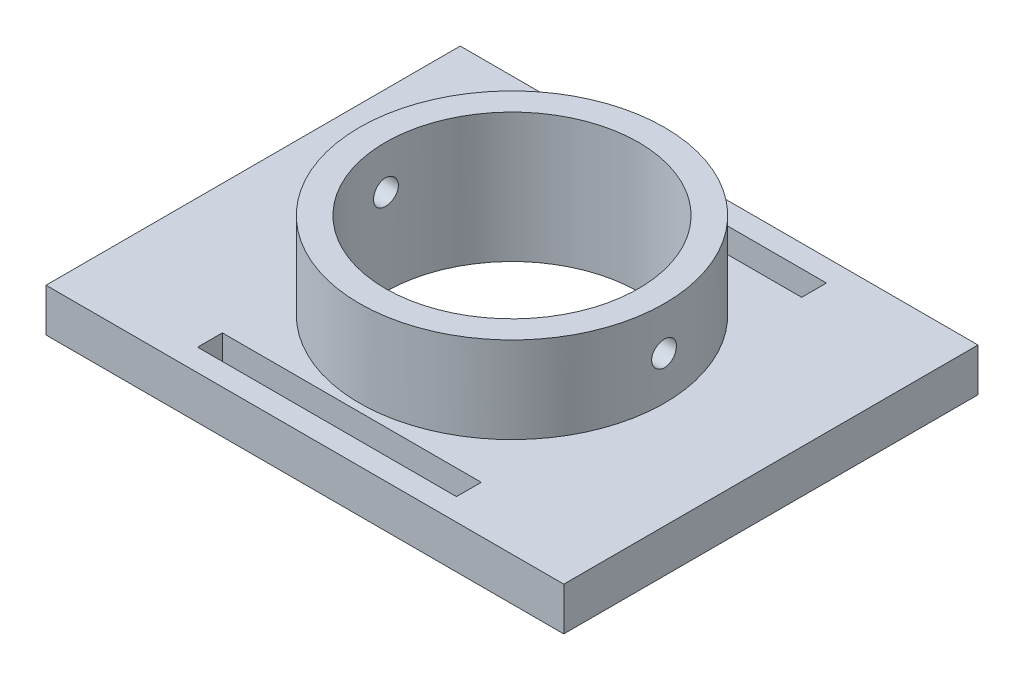
ISO-10303-21;
HEADER;
FILE_DESCRIPTION(('STEP AP214'),'2;1');
FILE_NAME('part.step','',(''),(''),'','','');
FILE_SCHEMA(('AUTOMOTIVE_DESIGN { 1 0 10303 214 1 1 1 1 }'));
ENDSEC;
DATA;
#1=APPLICATION_CONTEXT('core data for automotive mechanical design processes');
#2=APPLICATION_PROTOCOL_DEFINITION('international standard','automotive_design',2000,#1);
#3=PRODUCT_CONTEXT('',#1,'mechanical');
#4=PRODUCT('Part','Part','',(#3));
#5=PRODUCT_RELATED_PRODUCT_CATEGORY('part','',(#4));
#6=PRODUCT_DEFINITION_FORMATION('','',#4);
#7=PRODUCT_DEFINITION_CONTEXT('part definition',#1,'design');
#8=PRODUCT_DEFINITION('design','',#6,#7);
#9=PRODUCT_DEFINITION_SHAPE('','',#8);
#10=(LENGTH_UNIT() NAMED_UNIT(*) SI_UNIT(.MILLI.,.METRE.));
#11=(NAMED_UNIT(*) PLANE_ANGLE_UNIT() SI_UNIT($,.RADIAN.));
#12=(NAMED_UNIT(*) SI_UNIT($,.STERADIAN.) SOLID_ANGLE_UNIT());
#13=UNCERTAINTY_MEASURE_WITH_UNIT(LENGTH_MEASURE(1.E-05),#10,'distance_accuracy_value','');
#14=(GEOMETRIC_REPRESENTATION_CONTEXT(3) GLOBAL_UNCERTAINTY_ASSIGNED_CONTEXT((#13)) GLOBAL_UNIT_ASSIGNED_CONTEXT((#10,
#11,#12)) REPRESENTATION_CONTEXT('',''));
#15=CARTESIAN_POINT('',(0.,0.,0.));
#16=DIRECTION('',(0.,0.,1.));
#17=DIRECTION('',(1.,0.,0.));
#18=AXIS2_PLACEMENT_3D('',#15,#16,#17);
#19=CARTESIAN_POINT('',(-30.,5.,-24.));
#20=DIRECTION('',(0.,0.,-1.));
#21=DIRECTION('',(-1.,0.,0.));
#22=AXIS2_PLACEMENT_3D('',#19,#20,#21);
#23=PLANE('',#22);
#24=DIRECTION('',(1.,0.,0.));
#25=VECTOR('',#24,1.);
#26=CARTESIAN_POINT('',(-30.,0.,-24.));
#27=LINE('',#26,#25);
#28=CARTESIAN_POINT('',(-30.,0.,-24.));
#29=VERTEX_POINT('',#28);
#30=CARTESIAN_POINT('',(30.,0.,-24.));
#31=VERTEX_POINT('',#30);
#32=EDGE_CURVE('E210',#29,#31,#27,.T.);
#33=ORIENTED_EDGE('',*,*,#32,.F.);
#34=DIRECTION('',(0.,-1.,0.));
#35=VECTOR('',#34,1.);
#36=CARTESIAN_POINT('',(-30.,5.,-24.));
#37=LINE('',#36,#35);
#38=CARTESIAN_POINT('',(-30.,5.,-24.));
#39=VERTEX_POINT('',#38);
#40=EDGE_CURVE('E45',#39,#29,#37,.T.);
#41=ORIENTED_EDGE('',*,*,#40,.F.);
#42=DIRECTION('',(1.,0.,0.));
#43=VECTOR('',#42,1.);
#44=CARTESIAN_POINT('',(-30.,5.,-24.));
#45=LINE('',#44,#43);
#46=CARTESIAN_POINT('',(30.,5.,-24.));
#47=VERTEX_POINT('',#46);
#48=EDGE_CURVE('E211',#39,#47,#45,.T.);
#49=ORIENTED_EDGE('',*,*,#48,.T.);
#50=DIRECTION('',(0.,-1.,0.));
#51=VECTOR('',#50,1.);
#52=CARTESIAN_POINT('',(30.,5.,-24.));
#53=LINE('',#52,#51);
#54=EDGE_CURVE('E222',#47,#31,#53,.T.);
#55=ORIENTED_EDGE('',*,*,#54,.T.);
#56=EDGE_LOOP('',(#33,#41,#49,#55));
#57=FACE_BOUND('',#56,.T.);
#58=ADVANCED_FACE('F33',(#57),#23,.T.);
#59=CARTESIAN_POINT('',(-30.,5.,-24.));
#60=DIRECTION('',(1.,0.,0.));
#61=DIRECTION('',(0.,0.,-1.));
#62=AXIS2_PLACEMENT_3D('',#59,#60,#61);
#63=PLANE('',#62);
#64=DIRECTION('',(0.,0.,1.));
#65=VECTOR('',#64,1.);
#66=CARTESIAN_POINT('',(-30.,0.,-24.));
#67=LINE('',#66,#65);
#68=CARTESIAN_POINT('',(-30.,0.,24.));
#69=VERTEX_POINT('',#68);
#70=EDGE_CURVE('E215',#29,#69,#67,.T.);
#71=ORIENTED_EDGE('',*,*,#70,.T.);
#72=DIRECTION('',(0.,-1.,0.));
#73=VECTOR('',#72,1.);
#74=CARTESIAN_POINT('',(-30.,5.,24.));
#75=LINE('',#74,#73);
#76=CARTESIAN_POINT('',(-30.,5.,24.));
#77=VERTEX_POINT('',#76);
#78=EDGE_CURVE('E233',#77,#69,#75,.T.);
#79=ORIENTED_EDGE('',*,*,#78,.F.);
#80=DIRECTION('',(0.,0.,1.));
#81=VECTOR('',#80,1.);
#82=CARTESIAN_POINT('',(-30.,5.,-24.));
#83=LINE('',#82,#81);
#84=EDGE_CURVE('E220',#39,#77,#83,.T.);
#85=ORIENTED_EDGE('',*,*,#84,.F.);
#86=ORIENTED_EDGE('',*,*,#40,.T.);
#87=EDGE_LOOP('',(#71,#79,#85,#86));
#88=FACE_BOUND('',#87,.T.);
#89=ADVANCED_FACE('F275',(#88),#63,.F.);
#90=CARTESIAN_POINT('',(-30.,5.,24.));
#91=DIRECTION('',(0.,0.,-1.));
#92=DIRECTION('',(-1.,0.,0.));
#93=AXIS2_PLACEMENT_3D('',#90,#91,#92);
#94=PLANE('',#93);
#95=DIRECTION('',(1.,0.,0.));
#96=VECTOR('',#95,1.);
#97=CARTESIAN_POINT('',(-30.,0.,24.));
#98=LINE('',#97,#96);
#99=CARTESIAN_POINT('',(30.,0.,24.));
#100=VERTEX_POINT('',#99);
#101=EDGE_CURVE('E228',#69,#100,#98,.T.);
#102=ORIENTED_EDGE('',*,*,#101,.T.);
#103=DIRECTION('',(0.,-1.,0.));
#104=VECTOR('',#103,1.);
#105=CARTESIAN_POINT('',(30.,5.,24.));
#106=LINE('',#105,#104);
#107=CARTESIAN_POINT('',(30.,5.,24.));
#108=VERTEX_POINT('',#107);
#109=EDGE_CURVE('E236',#108,#100,#106,.T.);
#110=ORIENTED_EDGE('',*,*,#109,.F.);
#111=DIRECTION('',(1.,0.,0.));
#112=VECTOR('',#111,1.);
#113=CARTESIAN_POINT('',(-30.,5.,24.));
#114=LINE('',#113,#112);
#115=EDGE_CURVE('E218',#77,#108,#114,.T.);
#116=ORIENTED_EDGE('',*,*,#115,.F.);
#117=ORIENTED_EDGE('',*,*,#78,.T.);
#118=EDGE_LOOP('',(#102,#110,#116,#117));
#119=FACE_BOUND('',#118,.T.);
#120=ADVANCED_FACE('F278',(#119),#94,.F.);
#121=CARTESIAN_POINT('',(30.,5.,-24.));
#122=DIRECTION('',(1.,0.,0.));
#123=DIRECTION('',(0.,0.,-1.));
#124=AXIS2_PLACEMENT_3D('',#121,#122,#123);
#125=PLANE('',#124);
#126=DIRECTION('',(0.,0.,1.));
#127=VECTOR('',#126,1.);
#128=CARTESIAN_POINT('',(30.,0.,-24.));
#129=LINE('',#128,#127);
#130=EDGE_CURVE('E225',#31,#100,#129,.T.);
#131=ORIENTED_EDGE('',*,*,#130,.F.);
#132=ORIENTED_EDGE('',*,*,#54,.F.);
#133=DIRECTION('',(0.,0.,1.));
#134=VECTOR('',#133,1.);
#135=CARTESIAN_POINT('',(30.,5.,-24.));
#136=LINE('',#135,#134);
#137=EDGE_CURVE('E214',#47,#108,#136,.T.);
#138=ORIENTED_EDGE('',*,*,#137,.T.);
#139=ORIENTED_EDGE('',*,*,#109,.T.);
#140=EDGE_LOOP('',(#131,#132,#138,#139));
#141=FACE_BOUND('',#140,.T.);
#142=ADVANCED_FACE('F271',(#141),#125,.T.);
#143=CARTESIAN_POINT('',(0.,5.,0.));
#144=DIRECTION('',(0.,-1.,0.));
#145=DIRECTION('',(0.,0.,-1.));
#146=AXIS2_PLACEMENT_3D('',#143,#144,#145);
#147=PLANE('',#146);
#148=DIRECTION('',(-1.,0.,0.));
#149=VECTOR('',#148,1.);
#150=CARTESIAN_POINT('',(-15.,5.,18.565));
#151=LINE('',#150,#149);
#152=CARTESIAN_POINT('',(15.,5.,18.565));
#153=VERTEX_POINT('',#152);
#154=CARTESIAN_POINT('',(-15.,5.,18.565));
#155=VERTEX_POINT('',#154);
#156=EDGE_CURVE('E160',#153,#155,#151,.T.);
#157=ORIENTED_EDGE('',*,*,#156,.F.);
#158=DIRECTION('',(0.,0.,-1.));
#159=VECTOR('',#158,1.);
#160=CARTESIAN_POINT('',(15.,5.,18.565));
#161=LINE('',#160,#159);
#162=CARTESIAN_POINT('',(15.,5.,21.435));
#163=VERTEX_POINT('',#162);
#164=EDGE_CURVE('E53',#163,#153,#161,.T.);
#165=ORIENTED_EDGE('',*,*,#164,.F.);
#166=DIRECTION('',(1.,0.,0.));
#167=VECTOR('',#166,1.);
#168=CARTESIAN_POINT('',(-15.,5.,21.435));
#169=LINE('',#168,#167);
#170=CARTESIAN_POINT('',(-15.,5.,21.435));
#171=VERTEX_POINT('',#170);
#172=EDGE_CURVE('E145',#171,#163,#169,.T.);
#173=ORIENTED_EDGE('',*,*,#172,.F.);
#174=DIRECTION('',(0.,0.,1.));
#175=VECTOR('',#174,1.);
#176=CARTESIAN_POINT('',(-15.,5.,18.565));
#177=LINE('',#176,#175);
#178=EDGE_CURVE('E148',#155,#171,#177,.T.);
#179=ORIENTED_EDGE('',*,*,#178,.F.);
#180=EDGE_LOOP('',(#157,#165,#173,#179));
#181=FACE_BOUND('',#180,.T.);
#182=DIRECTION('',(-1.,0.,0.));
#183=VECTOR('',#182,1.);
#184=CARTESIAN_POINT('',(-15.,5.,-21.435));
#185=LINE('',#184,#183);
#186=CARTESIAN_POINT('',(15.,5.,-21.435));
#187=VERTEX_POINT('',#186);
#188=CARTESIAN_POINT('',(-15.,5.,-21.435));
#189=VERTEX_POINT('',#188);
#190=EDGE_CURVE('E185',#187,#189,#185,.T.);
#191=ORIENTED_EDGE('',*,*,#190,.F.);
#192=DIRECTION('',(0.,0.,-1.));
#193=VECTOR('',#192,1.);
#194=CARTESIAN_POINT('',(15.,5.,-21.435));
#195=LINE('',#194,#193);
#196=CARTESIAN_POINT('',(15.,5.,-18.565));
#197=VERTEX_POINT('',#196);
#198=EDGE_CURVE('E166',#197,#187,#195,.T.);
#199=ORIENTED_EDGE('',*,*,#198,.F.);
#200=DIRECTION('',(1.,0.,0.));
#201=VECTOR('',#200,1.);
#202=CARTESIAN_POINT('',(-15.,5.,-18.565));
#203=LINE('',#202,#201);
#204=CARTESIAN_POINT('',(-15.,5.,-18.565));
#205=VERTEX_POINT('',#204);
#206=EDGE_CURVE('E174',#205,#197,#203,.T.);
#207=ORIENTED_EDGE('',*,*,#206,.F.);
#208=DIRECTION('',(0.,0.,1.));
#209=VECTOR('',#208,1.);
#210=CARTESIAN_POINT('',(-15.,5.,-21.435));
#211=LINE('',#210,#209);
#212=EDGE_CURVE('E188',#189,#205,#211,.T.);
#213=ORIENTED_EDGE('',*,*,#212,.F.);
#214=EDGE_LOOP('',(#191,#199,#207,#213));
#215=FACE_BOUND('',#214,.T.);
#216=CARTESIAN_POINT('',(0.,5.,0.));
#217=DIRECTION('',(0.,-1.,0.));
#218=DIRECTION('',(0.,0.,-1.));
#219=AXIS2_PLACEMENT_3D('',#216,#217,#218);
#220=CIRCLE('',#219,17.675);
#221=CARTESIAN_POINT('',(0.,5.,-17.675));
#222=VERTEX_POINT('',#221);
#223=EDGE_CURVE('E11',#222,#222,#220,.F.);
#224=ORIENTED_EDGE('',*,*,#223,.F.);
#225=EDGE_LOOP('',(#224));
#226=FACE_BOUND('',#225,.T.);
#227=ORIENTED_EDGE('',*,*,#48,.F.);
#228=ORIENTED_EDGE('',*,*,#84,.T.);
#229=ORIENTED_EDGE('',*,*,#115,.T.);
#230=ORIENTED_EDGE('',*,*,#137,.F.);
#231=EDGE_LOOP('',(#227,#228,#229,#230));
#232=FACE_BOUND('',#231,.T.);
#233=ADVANCED_FACE('F267',(#181,#215,#226,#232),#147,.F.);
#234=CARTESIAN_POINT('',(0.,0.,0.));
#235=DIRECTION('',(0.,-1.,0.));
#236=DIRECTION('',(0.,0.,-1.));
#237=AXIS2_PLACEMENT_3D('',#234,#235,#236);
#238=PLANE('',#237);
#239=DIRECTION('',(0.,0.,-1.));
#240=VECTOR('',#239,1.);
#241=CARTESIAN_POINT('',(15.,0.,18.565));
#242=LINE('',#241,#240);
#243=CARTESIAN_POINT('',(15.,0.,21.435));
#244=VERTEX_POINT('',#243);
#245=CARTESIAN_POINT('',(15.,0.,18.565));
#246=VERTEX_POINT('',#245);
#247=EDGE_CURVE('E129',#244,#246,#242,.T.);
#248=ORIENTED_EDGE('',*,*,#247,.T.);
#249=DIRECTION('',(-1.,0.,0.));
#250=VECTOR('',#249,1.);
#251=CARTESIAN_POINT('',(-15.,0.,18.565));
#252=LINE('',#251,#250);
#253=CARTESIAN_POINT('',(-15.,0.,18.565));
#254=VERTEX_POINT('',#253);
#255=EDGE_CURVE('E138',#246,#254,#252,.T.);
#256=ORIENTED_EDGE('',*,*,#255,.T.);
#257=DIRECTION('',(0.,0.,1.));
#258=VECTOR('',#257,1.);
#259=CARTESIAN_POINT('',(-15.,0.,18.565));
#260=LINE('',#259,#258);
#261=CARTESIAN_POINT('',(-15.,0.,21.435));
#262=VERTEX_POINT('',#261);
#263=EDGE_CURVE('E61',#254,#262,#260,.T.);
#264=ORIENTED_EDGE('',*,*,#263,.T.);
#265=DIRECTION('',(1.,0.,0.));
#266=VECTOR('',#265,1.);
#267=CARTESIAN_POINT('',(-15.,0.,21.435));
#268=LINE('',#267,#266);
#269=EDGE_CURVE('E135',#262,#244,#268,.T.);
#270=ORIENTED_EDGE('',*,*,#269,.T.);
#271=EDGE_LOOP('',(#248,#256,#264,#270));
#272=FACE_BOUND('',#271,.T.);
#273=DIRECTION('',(0.,0.,-1.));
#274=VECTOR('',#273,1.);
#275=CARTESIAN_POINT('',(15.,0.,-21.435));
#276=LINE('',#275,#274);
#277=CARTESIAN_POINT('',(15.,0.,-18.565));
#278=VERTEX_POINT('',#277);
#279=CARTESIAN_POINT('',(15.,0.,-21.435));
#280=VERTEX_POINT('',#279);
#281=EDGE_CURVE('E170',#278,#280,#276,.T.);
#282=ORIENTED_EDGE('',*,*,#281,.T.);
#283=DIRECTION('',(-1.,0.,0.));
#284=VECTOR('',#283,1.);
#285=CARTESIAN_POINT('',(-15.,0.,-21.435));
#286=LINE('',#285,#284);
#287=CARTESIAN_POINT('',(-15.,0.,-21.435));
#288=VERTEX_POINT('',#287);
#289=EDGE_CURVE('E173',#280,#288,#286,.T.);
#290=ORIENTED_EDGE('',*,*,#289,.T.);
#291=DIRECTION('',(0.,0.,1.));
#292=VECTOR('',#291,1.);
#293=CARTESIAN_POINT('',(-15.,0.,-21.435));
#294=LINE('',#293,#292);
#295=CARTESIAN_POINT('',(-15.,0.,-18.565));
#296=VERTEX_POINT('',#295);
#297=EDGE_CURVE('E177',#288,#296,#294,.T.);
#298=ORIENTED_EDGE('',*,*,#297,.T.);
#299=DIRECTION('',(1.,0.,0.));
#300=VECTOR('',#299,1.);
#301=CARTESIAN_POINT('',(-15.,0.,-18.565));
#302=LINE('',#301,#300);
#303=EDGE_CURVE('E180',#296,#278,#302,.T.);
#304=ORIENTED_EDGE('',*,*,#303,.T.);
#305=EDGE_LOOP('',(#282,#290,#298,#304));
#306=FACE_BOUND('',#305,.T.);
#307=CARTESIAN_POINT('',(0.,0.,0.));
#308=DIRECTION('',(0.,-1.,0.));
#309=DIRECTION('',(0.,0.,-1.));
#310=AXIS2_PLACEMENT_3D('',#307,#308,#309);
#311=CIRCLE('',#310,14.675);
#312=CARTESIAN_POINT('',(0.,0.,-14.675));
#313=VERTEX_POINT('',#312);
#314=EDGE_CURVE('E202',#313,#313,#311,.T.);
#315=ORIENTED_EDGE('',*,*,#314,.F.);
#316=EDGE_LOOP('',(#315));
#317=FACE_BOUND('',#316,.T.);
#318=ORIENTED_EDGE('',*,*,#32,.T.);
#319=ORIENTED_EDGE('',*,*,#130,.T.);
#320=ORIENTED_EDGE('',*,*,#101,.F.);
#321=ORIENTED_EDGE('',*,*,#70,.F.);
#322=EDGE_LOOP('',(#318,#319,#320,#321));
#323=FACE_BOUND('',#322,.T.);
#324=ADVANCED_FACE('F142',(#272,#306,#317,#323),#238,.T.);
#325=CARTESIAN_POINT('',(0.,15.,0.));
#326=DIRECTION('',(0.,-1.,0.));
#327=DIRECTION('',(0.,0.,-1.));
#328=AXIS2_PLACEMENT_3D('',#325,#326,#327);
#329=CYLINDRICAL_SURFACE('',#328,17.675);
#330=CARTESIAN_POINT('',(-17.6166512141213,10.,-1.435));
#331=CARTESIAN_POINT('',(-17.6166519880703,10.0804619370114,-1.43499648194415));
#332=CARTESIAN_POINT('',(-17.6172083982812,10.1609788328625,-1.42820985964783));
#333=CARTESIAN_POINT('',(-17.6193739306894,10.3197853542178,-1.40123634416947));
#334=CARTESIAN_POINT('',(-17.6209842494435,10.3980723424406,-1.38103421929176));
#335=CARTESIAN_POINT('',(-17.6250740147872,10.5500959791317,-1.32781735268439));
#336=CARTESIAN_POINT('',(-17.6275529725158,10.6238351596655,-1.29480981659035));
#337=CARTESIAN_POINT('',(-17.6331000867362,10.7647087397878,-1.21693177821352));
#338=CARTESIAN_POINT('',(-17.6361681161884,10.8318445587487,-1.17206383296885));
#339=CARTESIAN_POINT('',(-17.6425561064969,10.9577874787273,-1.07162001266366));
#340=CARTESIAN_POINT('',(-17.6458765986055,11.0165762261121,-1.01602115636413));
#341=CARTESIAN_POINT('',(-17.65239050515,11.1239985852305,-0.89574229057965));
#342=CARTESIAN_POINT('',(-17.6555839140586,11.17263175566,-0.831061886666076));
#343=CARTESIAN_POINT('',(-17.6614888373549,11.2584231081935,-0.69434699639329));
#344=CARTESIAN_POINT('',(-17.6641996851384,11.2955654684634,-0.622302550268267));
#345=CARTESIAN_POINT('',(-17.6688283328002,11.3572196556925,-0.472974165938948));
#346=CARTESIAN_POINT('',(-17.6707461459316,11.3817316937298,-0.395690315320017));
#347=CARTESIAN_POINT('',(-17.6735689293102,11.4173767581088,-0.238259136247807));
#348=CARTESIAN_POINT('',(-17.6744761414498,11.4285394024836,-0.158118554646877));
#349=CARTESIAN_POINT('',(-17.6751830972071,11.4372603618224,0.00290350733807125));
#350=CARTESIAN_POINT('',(-17.6749828604791,11.4348189182216,0.0837849745479679));
#351=CARTESIAN_POINT('',(-17.6734993318281,11.4164252504983,0.243792078146758));
#352=CARTESIAN_POINT('',(-17.6722185931463,11.4005048769602,0.322921402894116));
#353=CARTESIAN_POINT('',(-17.6687210672094,11.3556547838833,0.477380992417645));
#354=CARTESIAN_POINT('',(-17.6665042714328,11.3267249459114,0.552711222601415));
#355=CARTESIAN_POINT('',(-17.6613796529656,11.2566415715254,0.697535731282657));
#356=CARTESIAN_POINT('',(-17.6584710235638,11.2154737509301,0.767023067688127));
#357=CARTESIAN_POINT('',(-17.6522896611227,11.1220933877778,0.898113524920215));
#358=CARTESIAN_POINT('',(-17.6490169210798,11.0698806327555,0.959716494043063));
#359=CARTESIAN_POINT('',(-17.6424640548872,10.955712973804,1.07347572364104));
#360=CARTESIAN_POINT('',(-17.6391839346694,10.8937303973644,1.12560421659915));
#361=CARTESIAN_POINT('',(-17.6329955082002,10.7618790504837,1.21872028231223));
#362=CARTESIAN_POINT('',(-17.6300872022331,10.6920102740111,1.25970784654621));
#363=CARTESIAN_POINT('',(-17.6249711236662,10.5463505624028,1.32937740482768));
#364=CARTESIAN_POINT('',(-17.622763431315,10.4705589501019,1.35805798936211));
#365=CARTESIAN_POINT('',(-17.6193000640486,10.3152141731612,1.40227905505279));
#366=CARTESIAN_POINT('',(-17.6180443701491,10.2356610835649,1.41781979823896));
#367=CARTESIAN_POINT('',(-17.6166302173941,10.0752944614033,1.43528494950801));
#368=CARTESIAN_POINT('',(-17.6164686394055,9.99448517074961,1.43724806537516));
#369=CARTESIAN_POINT('',(-17.6172527783253,9.83368662741962,1.42760360077743));
#370=CARTESIAN_POINT('',(-17.6181984854382,9.75369736749524,1.41599614036374));
#371=CARTESIAN_POINT('',(-17.6210877908299,9.59692041725981,1.37957227232181));
#372=CARTESIAN_POINT('',(-17.6230300263872,9.52012850930892,1.35477390115662));
#373=CARTESIAN_POINT('',(-17.627692411453,9.37179550885297,1.29269047414312));
#374=CARTESIAN_POINT('',(-17.6304125728194,9.30025449640702,1.2554052279587));
#375=CARTESIAN_POINT('',(-17.6363318740828,9.16427686557897,1.16930838287918));
#376=CARTESIAN_POINT('',(-17.6395320805831,9.09985663678365,1.12047097341177));
#377=CARTESIAN_POINT('',(-17.646047263494,8.98011481067478,1.01269342658922));
#378=CARTESIAN_POINT('',(-17.6493622417794,8.92479336207223,0.953753124143947));
#379=CARTESIAN_POINT('',(-17.6557427193367,8.82468750570848,0.827275699479404));
#380=CARTESIAN_POINT('',(-17.6588076123023,8.7799282357193,0.759718646132036));
#381=CARTESIAN_POINT('',(-17.6643338521204,8.70238971261067,0.618024830245939));
#382=CARTESIAN_POINT('',(-17.6667952047401,8.66961034501647,0.543888130587876));
#383=CARTESIAN_POINT('',(-17.6708342347991,8.61700534830398,0.39122983737643));
#384=CARTESIAN_POINT('',(-17.6724129752194,8.59716413220684,0.312713644243918));
#385=CARTESIAN_POINT('',(-17.6745132073757,8.57094770661295,0.153450964641147));
#386=CARTESIAN_POINT('',(-17.6750347180055,8.56457225646848,0.0727045180540426));
#387=CARTESIAN_POINT('',(-17.674961763282,8.56547108377198,-0.0884786735073468));
#388=CARTESIAN_POINT('',(-17.6743705023969,8.57270616669369,-0.168915641405576));
#389=CARTESIAN_POINT('',(-17.6721447837472,8.60053900252757,-0.327428117162417));
#390=CARTESIAN_POINT('',(-17.670510324508,8.62113677432824,-0.405503621682878));
#391=CARTESIAN_POINT('',(-17.6663816323433,8.67510044564052,-0.557079792528151));
#392=CARTESIAN_POINT('',(-17.6638874430971,8.70846569649771,-0.630580691046246));
#393=CARTESIAN_POINT('',(-17.658318443963,8.78701264759722,-0.770943934174783));
#394=CARTESIAN_POINT('',(-17.6552436439338,8.83219414720796,-0.837806391474697));
#395=CARTESIAN_POINT('',(-17.6488480898218,8.93323808126373,-0.963195253302686));
#396=CARTESIAN_POINT('',(-17.6455266841547,8.98912947663141,-1.02169828640388));
#397=CARTESIAN_POINT('',(-17.6390177916511,9.10995525424231,-1.12851592141795));
#398=CARTESIAN_POINT('',(-17.63583033748,9.17489182577626,-1.17682804958895));
#399=CARTESIAN_POINT('',(-17.6299440117795,9.3120845605044,-1.26195434636122));
#400=CARTESIAN_POINT('',(-17.6272460293109,9.38435367843433,-1.29874767879779));
#401=CARTESIAN_POINT('',(-17.6226550175034,9.53401616214204,-1.35963081627731));
#402=CARTESIAN_POINT('',(-17.6207610611857,9.61140350732643,-1.38373525835268));
#403=CARTESIAN_POINT('',(-17.6184807140611,9.74104119243339,-1.4124025906244));
#404=CARTESIAN_POINT('',(-17.6177977951046,9.79245724771136,-1.42086539044643));
#405=CARTESIAN_POINT('',(-17.6168827953379,9.89590786799764,-1.4321652260898));
#406=CARTESIAN_POINT('',(-17.6166507133888,9.94794243144292,-1.43500227612509));
#407=CARTESIAN_POINT('',(-17.6166512141213,10.,-1.435));
#408=B_SPLINE_CURVE_WITH_KNOTS('',3,(#330,#331,#332,#333,#334,#335,#336,#337,#338,#339,#340,
#341,#342,#343,#344,#345,#346,#347,#348,#349,#350,#351,#352,#353,#354,#355,#356,#357,#358,#359,
#360,#361,#362,#363,#364,#365,#366,#367,#368,#369,#370,#371,#372,#373,#374,#375,#376,#377,#378,
#379,#380,#381,#382,#383,#384,#385,#386,#387,#388,#389,#390,#391,#392,#393,#394,#395,#396,#397,
#398,#399,#400,#401,#402,#403,#404,#405,#406,#407),.UNSPECIFIED.,.T.,.F.,(4,2,2,2,2,2,2,2,2,2,2,
2,2,2,2,2,2,2,2,2,2,2,2,2,2,2,2,2,2,2,2,2,2,2,2,2,2,2,4),(0.,0.241195742538855,
0.482665803226462,0.724000184750932,0.965282578303511,1.20708755196391,1.44890303091759,
1.69105000165114,1.93319292549279,2.17479760900788,2.41639800471602,2.65742908923623,
2.89846236805277,3.13977809314228,3.38109846070997,3.62311506282661,3.8651318500457,
4.10717634794949,4.34921601897629,4.5905653856425,4.83191261724384,5.07293069016626,
5.31395243706872,5.55551786293549,5.7970872365694,6.03922586910696,6.28136218781204,
6.5232062560468,6.7650460022313,7.00619038352722,7.24733510568749,7.48846757806614,
7.72959595645079,7.97138582084355,8.21323430997685,8.45551778048242,8.6975211535737,
8.85357128228544,9.00962101672223),.UNSPECIFIED.);
#409=CARTESIAN_POINT('',(-17.6166512141213,10.,-1.435));
#410=VERTEX_POINT('',#409);
#411=EDGE_CURVE('E151',#410,#410,#408,.T.);
#412=ORIENTED_EDGE('',*,*,#411,.T.);
#413=EDGE_LOOP('',(#412));
#414=FACE_BOUND('',#413,.T.);
#415=CARTESIAN_POINT('',(17.6166512141213,10.,-1.435));
#416=CARTESIAN_POINT('',(17.6166519880703,9.91953806298863,-1.43499648194415));
#417=CARTESIAN_POINT('',(17.6172083982812,9.83902116713751,-1.42820985964783));
#418=CARTESIAN_POINT('',(17.6193739306894,9.68021464578215,-1.40123634416947));
#419=CARTESIAN_POINT('',(17.6209842494435,9.60192765755943,-1.38103421929176));
#420=CARTESIAN_POINT('',(17.6250740147872,9.44990402086828,-1.32781735268439));
#421=CARTESIAN_POINT('',(17.6275529725158,9.37616484033454,-1.29480981659034));
#422=CARTESIAN_POINT('',(17.6331000867362,9.23529126021223,-1.21693177821352));
#423=CARTESIAN_POINT('',(17.6361681161884,9.1681554412513,-1.17206383296885));
#424=CARTESIAN_POINT('',(17.6425561064969,9.04221252127269,-1.07162001266366));
#425=CARTESIAN_POINT('',(17.6458765986055,8.98342377388786,-1.01602115636413));
#426=CARTESIAN_POINT('',(17.65239050515,8.87600141476949,-0.89574229057965));
#427=CARTESIAN_POINT('',(17.6555839140586,8.82736824433997,-0.831061886666076));
#428=CARTESIAN_POINT('',(17.6614888373549,8.74157689180648,-0.69434699639329));
#429=CARTESIAN_POINT('',(17.6641996851384,8.70443453153661,-0.622302550268267));
#430=CARTESIAN_POINT('',(17.6688283328002,8.64278034430747,-0.472974165938948));
#431=CARTESIAN_POINT('',(17.6707461459316,8.61826830627023,-0.395690315320017));
#432=CARTESIAN_POINT('',(17.6735689293102,8.58262324189124,-0.238259136247807));
#433=CARTESIAN_POINT('',(17.6744761414498,8.5714605975164,-0.158118554646877));
#434=CARTESIAN_POINT('',(17.6751830972071,8.56273963817762,0.00290350733807124));
#435=CARTESIAN_POINT('',(17.6749828604791,8.56518108177844,0.0837849745479679));
#436=CARTESIAN_POINT('',(17.6734993318281,8.58357474950169,0.243792078146758));
#437=CARTESIAN_POINT('',(17.6722185931463,8.59949512303975,0.322921402894116));
#438=CARTESIAN_POINT('',(17.6687210672094,8.64434521611666,0.477380992417645));
#439=CARTESIAN_POINT('',(17.6665042714328,8.67327505408855,0.552711222601415));
#440=CARTESIAN_POINT('',(17.6613796529656,8.74335842847457,0.697535731282656));
#441=CARTESIAN_POINT('',(17.6584710235638,8.78452624906988,0.767023067688126));
#442=CARTESIAN_POINT('',(17.6522896611227,8.87790661222223,0.898113524920214));
#443=CARTESIAN_POINT('',(17.6490169210798,8.93011936724453,0.959716494043063));
#444=CARTESIAN_POINT('',(17.6424640548872,9.04428702619599,1.07347572364104));
#445=CARTESIAN_POINT('',(17.6391839346694,9.10626960263558,1.12560421659915));
#446=CARTESIAN_POINT('',(17.6329955082002,9.23812094951627,1.21872028231223));
#447=CARTESIAN_POINT('',(17.6300872022331,9.30798972598894,1.25970784654621));
#448=CARTESIAN_POINT('',(17.6249711236662,9.45364943759717,1.32937740482768));
#449=CARTESIAN_POINT('',(17.622763431315,9.5294410498981,1.35805798936211));
#450=CARTESIAN_POINT('',(17.6193000640486,9.68478582683877,1.40227905505279));
#451=CARTESIAN_POINT('',(17.6180443701491,9.7643389164351,1.41781979823896));
#452=CARTESIAN_POINT('',(17.6166302173941,9.92470553859674,1.43528494950801));
#453=CARTESIAN_POINT('',(17.6164686394055,10.0055148292504,1.43724806537516));
#454=CARTESIAN_POINT('',(17.6172527783253,10.1663133725804,1.42760360077743));
#455=CARTESIAN_POINT('',(17.6181984854382,10.2463026325048,1.41599614036374));
#456=CARTESIAN_POINT('',(17.6210877908299,10.4030795827402,1.37957227232181));
#457=CARTESIAN_POINT('',(17.6230300263872,10.4798714906911,1.35477390115662));
#458=CARTESIAN_POINT('',(17.627692411453,10.628204491147,1.29269047414312));
#459=CARTESIAN_POINT('',(17.6304125728194,10.699745503593,1.2554052279587));
#460=CARTESIAN_POINT('',(17.6363318740828,10.835723134421,1.16930838287918));
#461=CARTESIAN_POINT('',(17.6395320805831,10.9001433632163,1.12047097341177));
#462=CARTESIAN_POINT('',(17.646047263494,11.0198851893252,1.01269342658922));
#463=CARTESIAN_POINT('',(17.6493622417794,11.0752066379278,0.953753124143947));
#464=CARTESIAN_POINT('',(17.6557427193367,11.1753124942915,0.827275699479404));
#465=CARTESIAN_POINT('',(17.6588076123023,11.2200717642807,0.759718646132036));
#466=CARTESIAN_POINT('',(17.6643338521204,11.2976102873893,0.618024830245939));
#467=CARTESIAN_POINT('',(17.6667952047401,11.3303896549835,0.543888130587876));
#468=CARTESIAN_POINT('',(17.6708342347991,11.382994651696,0.39122983737643));
#469=CARTESIAN_POINT('',(17.6724129752194,11.4028358677932,0.312713644243918));
#470=CARTESIAN_POINT('',(17.6745132073757,11.429052293387,0.153450964641147));
#471=CARTESIAN_POINT('',(17.6750347180055,11.4354277435315,0.0727045180540426));
#472=CARTESIAN_POINT('',(17.674961763282,11.434528916228,-0.0884786735073468));
#473=CARTESIAN_POINT('',(17.6743705023969,11.4272938333063,-0.168915641405576));
#474=CARTESIAN_POINT('',(17.6721447837472,11.3994609974724,-0.327428117162417));
#475=CARTESIAN_POINT('',(17.670510324508,11.3788632256718,-0.405503621682878));
#476=CARTESIAN_POINT('',(17.6663816323433,11.3248995543595,-0.557079792528151));
#477=CARTESIAN_POINT('',(17.6638874430971,11.2915343035023,-0.630580691046246));
#478=CARTESIAN_POINT('',(17.658318443963,11.2129873524028,-0.770943934174783));
#479=CARTESIAN_POINT('',(17.6552436439338,11.167805852792,-0.837806391474697));
#480=CARTESIAN_POINT('',(17.6488480898218,11.0667619187363,-0.963195253302686));
#481=CARTESIAN_POINT('',(17.6455266841547,11.0108705233686,-1.02169828640388));
#482=CARTESIAN_POINT('',(17.6390177916511,10.8900447457577,-1.12851592141795));
#483=CARTESIAN_POINT('',(17.63583033748,10.8251081742237,-1.17682804958895));
#484=CARTESIAN_POINT('',(17.6299440117795,10.6879154394956,-1.26195434636122));
#485=CARTESIAN_POINT('',(17.6272460293109,10.6156463215657,-1.29874767879779));
#486=CARTESIAN_POINT('',(17.6226550175034,10.465983837858,-1.35963081627731));
#487=CARTESIAN_POINT('',(17.6207610611857,10.3885964926736,-1.38373525835268));
#488=CARTESIAN_POINT('',(17.6184807140611,10.2589588075666,-1.4124025906244));
#489=CARTESIAN_POINT('',(17.6177977951046,10.2075427522886,-1.42086539044643));
#490=CARTESIAN_POINT('',(17.6168827953379,10.1040921320024,-1.4321652260898));
#491=CARTESIAN_POINT('',(17.6166507133888,10.0520575685571,-1.43500227612509));
#492=CARTESIAN_POINT('',(17.6166512141213,10.,-1.435));
#493=B_SPLINE_CURVE_WITH_KNOTS('',3,(#415,#416,#417,#418,#419,#420,#421,#422,#423,#424,#425,
#426,#427,#428,#429,#430,#431,#432,#433,#434,#435,#436,#437,#438,#439,#440,#441,#442,#443,#444,
#445,#446,#447,#448,#449,#450,#451,#452,#453,#454,#455,#456,#457,#458,#459,#460,#461,#462,#463,
#464,#465,#466,#467,#468,#469,#470,#471,#472,#473,#474,#475,#476,#477,#478,#479,#480,#481,#482,
#483,#484,#485,#486,#487,#488,#489,#490,#491,#492),.UNSPECIFIED.,.T.,.F.,(4,2,2,2,2,2,2,2,2,2,2,
2,2,2,2,2,2,2,2,2,2,2,2,2,2,2,2,2,2,2,2,2,2,2,2,2,2,2,4),(0.,0.241195742538855,
0.482665803226462,0.724000184750938,0.965282578303511,1.20708755196391,1.44890303091759,
1.69105000165114,1.93319292549279,2.17479760900788,2.41639800471602,2.65742908923623,
2.89846236805277,3.13977809314227,3.38109846070997,3.62311506282661,3.8651318500457,
4.10717634794949,4.3492160189763,4.5905653856425,4.83191261724384,5.07293069016626,
5.31395243706872,5.55551786293549,5.7970872365694,6.03922586910696,6.28136218781205,
6.5232062560468,6.7650460022313,7.00619038352722,7.24733510568749,7.48846757806614,
7.72959595645079,7.97138582084355,8.21323430997685,8.45551778048242,8.6975211535737,
8.85357128228544,9.00962101672223),.UNSPECIFIED.);
#494=CARTESIAN_POINT('',(17.6166512141213,10.,-1.435));
#495=VERTEX_POINT('',#494);
#496=EDGE_CURVE('E257',#495,#495,#493,.T.);
#497=ORIENTED_EDGE('',*,*,#496,.T.);
#498=EDGE_LOOP('',(#497));
#499=FACE_BOUND('',#498,.T.);
#500=CARTESIAN_POINT('',(0.,15.,0.));
#501=DIRECTION('',(0.,1.,0.));
#502=DIRECTION('',(0.,0.,1.));
#503=AXIS2_PLACEMENT_3D('',#500,#501,#502);
#504=CIRCLE('',#503,17.675);
#505=CARTESIAN_POINT('',(0.,15.,17.675));
#506=VERTEX_POINT('',#505);
#507=EDGE_CURVE('E205',#506,#506,#504,.T.);
#508=ORIENTED_EDGE('',*,*,#507,.F.);
#509=EDGE_LOOP('',(#508));
#510=FACE_BOUND('',#509,.T.);
#511=ORIENTED_EDGE('',*,*,#223,.T.);
#512=EDGE_LOOP('',(#511));
#513=FACE_BOUND('',#512,.T.);
#514=ADVANCED_FACE('F261',(#414,#499,#510,#513),#329,.T.);
#515=CARTESIAN_POINT('',(0.,15.,0.));
#516=DIRECTION('',(0.,1.,0.));
#517=DIRECTION('',(0.,0.,1.));
#518=AXIS2_PLACEMENT_3D('',#515,#516,#517);
#519=PLANE('',#518);
#520=CARTESIAN_POINT('',(0.,15.,0.));
#521=DIRECTION('',(0.,1.,0.));
#522=DIRECTION('',(0.,0.,1.));
#523=AXIS2_PLACEMENT_3D('',#520,#521,#522);
#524=CIRCLE('',#523,14.675);
#525=CARTESIAN_POINT('',(0.,15.,14.675));
#526=VERTEX_POINT('',#525);
#527=EDGE_CURVE('E195',#526,#526,#524,.F.);
#528=ORIENTED_EDGE('',*,*,#527,.T.);
#529=EDGE_LOOP('',(#528));
#530=FACE_BOUND('',#529,.T.);
#531=ORIENTED_EDGE('',*,*,#507,.T.);
#532=EDGE_LOOP('',(#531));
#533=FACE_BOUND('',#532,.T.);
#534=ADVANCED_FACE('F265',(#530,#533),#519,.T.);
#535=CARTESIAN_POINT('',(0.,15.001,0.));
#536=DIRECTION('',(0.,-1.,0.));
#537=DIRECTION('',(0.,0.,-1.));
#538=AXIS2_PLACEMENT_3D('',#535,#536,#537);
#539=CYLINDRICAL_SURFACE('',#538,14.675);
#540=CARTESIAN_POINT('',(-14.6046704858412,10.,-1.435));
#541=CARTESIAN_POINT('',(-14.6046714090223,9.91960242943881,-1.43499651294553));
#542=CARTESIAN_POINT('',(-14.6053415129742,9.83915147411864,-1.4282206947927));
#543=CARTESIAN_POINT('',(-14.6079492034345,9.68047944200119,-1.40129261425176));
#544=CARTESIAN_POINT('',(-14.6098881923681,9.60226093254028,-1.3811255509324));
#545=CARTESIAN_POINT('',(-14.6148119668361,9.4503746202703,-1.32800726411255));
#546=CARTESIAN_POINT('',(-14.617796124153,9.376704115019,-1.2950637188767));
#547=CARTESIAN_POINT('',(-14.624473221016,9.23595438001838,-1.21734220938301));
#548=CARTESIAN_POINT('',(-14.6281660182115,9.16887383057395,-1.17256662124737));
#549=CARTESIAN_POINT('',(-14.6358587221478,9.04295836811762,-1.07228437020856));
#550=CARTESIAN_POINT('',(-14.63985954437,8.98414962860346,-1.01674491063649));
#551=CARTESIAN_POINT('',(-14.6477091861653,8.87667245896525,-0.896581475266948));
#552=CARTESIAN_POINT('',(-14.6515579988229,8.82800448975873,-0.83195708676544));
#553=CARTESIAN_POINT('',(-14.658678959041,8.74210033535445,-0.695298446489329));
#554=CARTESIAN_POINT('',(-14.6619499358657,8.70488724787316,-0.623249609205005));
#555=CARTESIAN_POINT('',(-14.6675367241989,8.64309696383973,-0.47388860391744));
#556=CARTESIAN_POINT('',(-14.6698525580468,8.61851947175537,-0.396576559062544));
#557=CARTESIAN_POINT('',(-14.6732617066913,8.58277462436778,-0.239147698291305));
#558=CARTESIAN_POINT('',(-14.6743589320829,8.5715643641559,-0.159040710130819));
#559=CARTESIAN_POINT('',(-14.675220529448,8.56273946063028,0.00192472946816802));
#560=CARTESIAN_POINT('',(-14.6749849345814,8.56512447907251,0.0827831621611175));
#561=CARTESIAN_POINT('',(-14.6732106411098,8.58338756479089,0.242665005437445));
#562=CARTESIAN_POINT('',(-14.671676398209,8.59921949590325,0.321693742441129));
#563=CARTESIAN_POINT('',(-14.6674823738609,8.64385514205533,0.475966929861939));
#564=CARTESIAN_POINT('',(-14.6648225783437,8.67265901924998,0.551211332960183));
#565=CARTESIAN_POINT('',(-14.6586688507786,8.74247162670859,0.695925564602561));
#566=CARTESIAN_POINT('',(-14.6551735229548,8.78350080820264,0.765385465367076));
#567=CARTESIAN_POINT('',(-14.6477410204539,8.87658450635661,0.896450647154379));
#568=CARTESIAN_POINT('',(-14.6438038333912,8.92863933210786,0.958055707898124));
#569=CARTESIAN_POINT('',(-14.6359100908414,9.04255622282441,1.07193262578679));
#570=CARTESIAN_POINT('',(-14.6319535232485,9.104458415456,1.12416434863977));
#571=CARTESIAN_POINT('',(-14.6244834095225,9.23617363401798,1.21750129887854));
#572=CARTESIAN_POINT('',(-14.6209698639869,9.30598667061575,1.25860651126053));
#573=CARTESIAN_POINT('',(-14.6147832425359,9.45157230334828,1.32852322977978));
#574=CARTESIAN_POINT('',(-14.61211033227,9.52734607038785,1.35733231333124));
#575=CARTESIAN_POINT('',(-14.6079110123107,9.68268724208881,1.40180752231116));
#576=CARTESIAN_POINT('',(-14.6063845692496,9.76225453626848,1.41747403025381));
#577=CARTESIAN_POINT('',(-14.6046567372777,9.92257196624961,1.43516786403591));
#578=CARTESIAN_POINT('',(-14.6044498961531,10.0033158516435,1.43725131193631));
#579=CARTESIAN_POINT('',(-14.6053702987277,10.1640036190194,1.42786721872531));
#580=CARTESIAN_POINT('',(-14.6064975252041,10.2439475113158,1.41639985255467));
#581=CARTESIAN_POINT('',(-14.6099540906982,10.4006027447382,1.38028657824834));
#582=CARTESIAN_POINT('',(-14.6122810132964,10.4773202497402,1.35566715729774));
#583=CARTESIAN_POINT('',(-14.6178728177267,10.6255364849584,1.29397565311008));
#584=CARTESIAN_POINT('',(-14.6211377201304,10.6970351006722,1.25690329675531));
#585=CARTESIAN_POINT('',(-14.6282508117672,10.833039925025,1.17121747540756));
#586=CARTESIAN_POINT('',(-14.6321008672995,10.8975225854312,1.12256679080275));
#587=CARTESIAN_POINT('',(-14.639944322449,11.0174263920773,1.01515873263398));
#588=CARTESIAN_POINT('',(-14.6439377254578,11.072847323753,0.956401119825111));
#589=CARTESIAN_POINT('',(-14.6516343446027,11.1732477304391,0.830203783959675));
#590=CARTESIAN_POINT('',(-14.6553365147698,11.2181906150004,0.762734877513617));
#591=CARTESIAN_POINT('',(-14.6620183267058,11.2961074776378,0.621174476946697));
#592=CARTESIAN_POINT('',(-14.6649979779967,11.3290816134514,0.547083070120471));
#593=CARTESIAN_POINT('',(-14.6698942885067,11.3820628447462,0.394509063744723));
#594=CARTESIAN_POINT('',(-14.6718127647878,11.4020921158363,0.316034225341153));
#595=CARTESIAN_POINT('',(-14.6743780091345,11.428687447991,0.156815709668464));
#596=CARTESIAN_POINT('',(-14.6750248112651,11.4352538696928,0.0760720932331524));
#597=CARTESIAN_POINT('',(-14.6749738228292,11.4347321624338,-0.0850323779331628));
#598=CARTESIAN_POINT('',(-14.6742816288801,11.427700868038,-0.165393424539623));
#599=CARTESIAN_POINT('',(-14.6716414698024,11.4003024052112,-0.323786998711737));
#600=CARTESIAN_POINT('',(-14.669693503572,11.3799352250798,-0.401819524234346));
#601=CARTESIAN_POINT('',(-14.6647600981061,11.3264587060033,-0.553341137553346));
#602=CARTESIAN_POINT('',(-14.6617747870251,11.2933509409875,-0.626830785260668));
#603=CARTESIAN_POINT('',(-14.6550996383539,11.2153391695088,-0.767218686420982));
#604=CARTESIAN_POINT('',(-14.6514098058826,11.1704352487529,-0.834116987759708));
#605=CARTESIAN_POINT('',(-14.6437206586063,11.0698926102079,-0.95971443953719));
#606=CARTESIAN_POINT('',(-14.6397201629003,11.0142115972373,-1.01837966031564));
#607=CARTESIAN_POINT('',(-14.6318705743972,10.8937779958304,-1.1255596374921));
#608=CARTESIAN_POINT('',(-14.6280215182093,10.8290232309315,-1.17407195159539));
#609=CARTESIAN_POINT('',(-14.6209005205368,10.6921080713567,-1.25966172573063));
#610=CARTESIAN_POINT('',(-14.6176300132884,10.6199299548678,-1.29671093399021));
#611=CARTESIAN_POINT('',(-14.6120535506991,10.4703916681561,-1.35811463138317));
#612=CARTESIAN_POINT('',(-14.609746504976,10.3930374715901,-1.38248347904025));
#613=CARTESIAN_POINT('',(-14.6069416377535,10.2627021661361,-1.41173924177124));
#614=CARTESIAN_POINT('',(-14.6060939672511,10.2105550618344,-1.42045015198009));
#615=CARTESIAN_POINT('',(-14.6049580891581,10.1056129835386,-1.43208166503533));
#616=CARTESIAN_POINT('',(-14.6046698793478,10.0528180121158,-1.43500229085636));
#617=CARTESIAN_POINT('',(-14.6046704858412,10.,-1.435));
#618=B_SPLINE_CURVE_WITH_KNOTS('',3,(#540,#541,#542,#543,#544,#545,#546,#547,#548,#549,#550,
#551,#552,#553,#554,#555,#556,#557,#558,#559,#560,#561,#562,#563,#564,#565,#566,#567,#568,#569,
#570,#571,#572,#573,#574,#575,#576,#577,#578,#579,#580,#581,#582,#583,#584,#585,#586,#587,#588,
#589,#590,#591,#592,#593,#594,#595,#596,#597,#598,#599,#600,#601,#602,#603,#604,#605,#606,#607,
#608,#609,#610,#611,#612,#613,#614,#615,#616,#617),.UNSPECIFIED.,.T.,.F.,(4,2,2,2,2,2,2,2,2,2,2,
2,2,2,2,2,2,2,2,2,2,2,2,2,2,2,2,2,2,2,2,2,2,2,2,2,2,2,4),(0.,0.240999834459086,
0.482266482987136,0.723388361949724,0.964461855335783,1.2062817686436,1.44811267073576,
1.69042805573546,1.93273777299565,2.17426763516678,2.41579148821663,2.65649000833655,
2.89719153737552,3.13829800902536,3.37941124071447,3.62153343016963,3.86365594611852,
4.10582614309934,4.347989291481,4.58915124021557,4.83031007558793,5.07098505725855,
5.31166531775629,5.55312997412191,5.79460034707517,6.03690173528981,6.27919993007419,
6.52108194030558,6.76295747101878,7.00382421587248,7.24469117205659,7.48552838188802,
7.7263638419226,7.96816437211082,8.21002300104113,8.45247304780352,8.69464795711309,
8.85297590899471,9.01130323266288),.UNSPECIFIED.);
#619=CARTESIAN_POINT('',(-14.6046704858412,10.,-1.435));
#620=VERTEX_POINT('',#619);
#621=EDGE_CURVE('E36',#620,#620,#618,.T.);
#622=ORIENTED_EDGE('',*,*,#621,.T.);
#623=EDGE_LOOP('',(#622));
#624=FACE_BOUND('',#623,.T.);
#625=CARTESIAN_POINT('',(14.6046704858412,10.,-1.435));
#626=CARTESIAN_POINT('',(14.6046714090223,10.0803975705612,-1.43499651294553));
#627=CARTESIAN_POINT('',(14.6053415129743,10.1608485258814,-1.4282206947927));
#628=CARTESIAN_POINT('',(14.6079492034345,10.3195205579988,-1.40129261425176));
#629=CARTESIAN_POINT('',(14.6098881923681,10.3977390674597,-1.3811255509324));
#630=CARTESIAN_POINT('',(14.6148119668361,10.5496253797297,-1.32800726411255));
#631=CARTESIAN_POINT('',(14.617796124153,10.623295884981,-1.2950637188767));
#632=CARTESIAN_POINT('',(14.624473221016,10.7640456199816,-1.21734220938301));
#633=CARTESIAN_POINT('',(14.6281660182115,10.831126169426,-1.17256662124737));
#634=CARTESIAN_POINT('',(14.6358587221478,10.9570416318824,-1.07228437020856));
#635=CARTESIAN_POINT('',(14.63985954437,11.0158503713965,-1.01674491063649));
#636=CARTESIAN_POINT('',(14.6477091861653,11.1233275410348,-0.896581475266947));
#637=CARTESIAN_POINT('',(14.6515579988229,11.1719955102413,-0.83195708676544));
#638=CARTESIAN_POINT('',(14.658678959041,11.2578996646455,-0.695298446489329));
#639=CARTESIAN_POINT('',(14.6619499358657,11.2951127521268,-0.623249609205005));
#640=CARTESIAN_POINT('',(14.6675367241989,11.3569030361603,-0.47388860391744));
#641=CARTESIAN_POINT('',(14.6698525580468,11.3814805282446,-0.396576559062543));
#642=CARTESIAN_POINT('',(14.6732617066913,11.4172253756322,-0.239147698291305));
#643=CARTESIAN_POINT('',(14.6743589320829,11.4284356358441,-0.159040710130818));
#644=CARTESIAN_POINT('',(14.675220529448,11.4372605393697,0.00192472946816845));
#645=CARTESIAN_POINT('',(14.6749849345814,11.4348755209275,0.0827831621611179));
#646=CARTESIAN_POINT('',(14.6732106411098,11.4166124352091,0.242665005437445));
#647=CARTESIAN_POINT('',(14.671676398209,11.4007805040967,0.32169374244113));
#648=CARTESIAN_POINT('',(14.6674823738609,11.3561448579447,0.47596692986194));
#649=CARTESIAN_POINT('',(14.6648225783437,11.32734098075,0.551211332960184));
#650=CARTESIAN_POINT('',(14.6586688507786,11.2575283732914,0.695925564602562));
#651=CARTESIAN_POINT('',(14.6551735229548,11.2164991917974,0.765385465367078));
#652=CARTESIAN_POINT('',(14.6477410204539,11.1234154936434,0.89645064715438));
#653=CARTESIAN_POINT('',(14.6438038333912,11.0713606678921,0.958055707898124));
#654=CARTESIAN_POINT('',(14.6359100908414,10.9574437771756,1.07193262578679));
#655=CARTESIAN_POINT('',(14.6319535232485,10.895541584544,1.12416434863977));
#656=CARTESIAN_POINT('',(14.6244834095225,10.763826365982,1.21750129887854));
#657=CARTESIAN_POINT('',(14.6209698639869,10.6940133293842,1.25860651126053));
#658=CARTESIAN_POINT('',(14.6147832425359,10.5484276966517,1.32852322977978));
#659=CARTESIAN_POINT('',(14.61211033227,10.4726539296121,1.35733231333124));
#660=CARTESIAN_POINT('',(14.6079110123107,10.3173127579112,1.40180752231116));
#661=CARTESIAN_POINT('',(14.6063845692496,10.2377454637315,1.41747403025381));
#662=CARTESIAN_POINT('',(14.6046567372777,10.0774280337504,1.43516786403591));
#663=CARTESIAN_POINT('',(14.6044498961531,9.99668414835653,1.43725131193631));
#664=CARTESIAN_POINT('',(14.6053702987277,9.83599638098064,1.42786721872531));
#665=CARTESIAN_POINT('',(14.6064975252041,9.75605248868415,1.41639985255467));
#666=CARTESIAN_POINT('',(14.6099540906982,9.59939725526178,1.38028657824834));
#667=CARTESIAN_POINT('',(14.6122810132964,9.52267975025981,1.35566715729774));
#668=CARTESIAN_POINT('',(14.6178728177267,9.37446351504158,1.29397565311008));
#669=CARTESIAN_POINT('',(14.6211377201304,9.30296489932784,1.25690329675531));
#670=CARTESIAN_POINT('',(14.6282508117672,9.16696007497501,1.17121747540756));
#671=CARTESIAN_POINT('',(14.6321008672995,9.10247741456882,1.12256679080275));
#672=CARTESIAN_POINT('',(14.639944322449,8.9825736079227,1.01515873263398));
#673=CARTESIAN_POINT('',(14.6439377254578,8.92715267624695,0.956401119825111));
#674=CARTESIAN_POINT('',(14.6516343446027,8.82675226956091,0.830203783959675));
#675=CARTESIAN_POINT('',(14.6553365147698,8.78180938499963,0.762734877513616));
#676=CARTESIAN_POINT('',(14.6620183267058,8.70389252236216,0.621174476946696));
#677=CARTESIAN_POINT('',(14.6649979779967,8.67091838654864,0.547083070120471));
#678=CARTESIAN_POINT('',(14.6698942885067,8.61793715525376,0.394509063744723));
#679=CARTESIAN_POINT('',(14.6718127647878,8.5979078841637,0.316034225341153));
#680=CARTESIAN_POINT('',(14.6743780091345,8.57131255200897,0.156815709668464));
#681=CARTESIAN_POINT('',(14.6750248112651,8.56474613030715,0.0760720932331523));
#682=CARTESIAN_POINT('',(14.6749738228292,8.56526783756616,-0.0850323779331629));
#683=CARTESIAN_POINT('',(14.6742816288801,8.57229913196204,-0.165393424539623));
#684=CARTESIAN_POINT('',(14.6716414698024,8.59969759478877,-0.323786998711738));
#685=CARTESIAN_POINT('',(14.669693503572,8.62006477492018,-0.401819524234347));
#686=CARTESIAN_POINT('',(14.6647600981061,8.67354129399669,-0.553341137553346));
#687=CARTESIAN_POINT('',(14.6617747870251,8.70664905901246,-0.626830785260669));
#688=CARTESIAN_POINT('',(14.6550996383539,8.7846608304912,-0.767218686420983));
#689=CARTESIAN_POINT('',(14.6514098058826,8.82956475124712,-0.834116987759709));
#690=CARTESIAN_POINT('',(14.6437206586063,8.93010738979213,-0.95971443953719));
#691=CARTESIAN_POINT('',(14.6397201629003,8.98578840276274,-1.01837966031564));
#692=CARTESIAN_POINT('',(14.6318705743972,9.10622200416957,-1.1255596374921));
#693=CARTESIAN_POINT('',(14.6280215182093,9.17097676906848,-1.17407195159539));
#694=CARTESIAN_POINT('',(14.6209005205368,9.30789192864327,-1.25966172573063));
#695=CARTESIAN_POINT('',(14.6176300132884,9.38007004513219,-1.29671093399021));
#696=CARTESIAN_POINT('',(14.6120535506991,9.52960833184389,-1.35811463138317));
#697=CARTESIAN_POINT('',(14.609746504976,9.60696252840988,-1.38248347904025));
#698=CARTESIAN_POINT('',(14.6069416377535,9.73729783386394,-1.41173924177124));
#699=CARTESIAN_POINT('',(14.6060939672511,9.78944493816557,-1.42045015198009));
#700=CARTESIAN_POINT('',(14.6049580891581,9.8943870164614,-1.43208166503533));
#701=CARTESIAN_POINT('',(14.6046698793478,9.94718198788416,-1.43500229085636));
#702=CARTESIAN_POINT('',(14.6046704858412,10.,-1.435));
#703=B_SPLINE_CURVE_WITH_KNOTS('',3,(#625,#626,#627,#628,#629,#630,#631,#632,#633,#634,#635,
#636,#637,#638,#639,#640,#641,#642,#643,#644,#645,#646,#647,#648,#649,#650,#651,#652,#653,#654,
#655,#656,#657,#658,#659,#660,#661,#662,#663,#664,#665,#666,#667,#668,#669,#670,#671,#672,#673,
#674,#675,#676,#677,#678,#679,#680,#681,#682,#683,#684,#685,#686,#687,#688,#689,#690,#691,#692,
#693,#694,#695,#696,#697,#698,#699,#700,#701,#702),.UNSPECIFIED.,.T.,.F.,(4,2,2,2,2,2,2,2,2,2,2,
2,2,2,2,2,2,2,2,2,2,2,2,2,2,2,2,2,2,2,2,2,2,2,2,2,2,2,4),(0.,0.240999834459086,
0.482266482987136,0.723388361949721,0.964461855335783,1.2062817686436,1.44811267073576,
1.69042805573546,1.93273777299566,2.17426763516678,2.41579148821664,2.65649000833655,
2.89719153737552,3.13829800902536,3.37941124071447,3.62153343016963,3.86365594611852,
4.10582614309934,4.347989291481,4.58915124021557,4.83031007558793,5.07098505725855,
5.31166531775629,5.55312997412191,5.79460034707517,6.03690173528981,6.27919993007419,
6.52108194030558,6.76295747101878,7.00382421587248,7.24469117205659,7.48552838188802,
7.7263638419226,7.96816437211082,8.21002300104113,8.45247304780352,8.69464795711309,
8.85297590899471,9.01130323266288),.UNSPECIFIED.);
#704=CARTESIAN_POINT('',(14.6046704858412,10.,-1.435));
#705=VERTEX_POINT('',#704);
#706=EDGE_CURVE('E238',#705,#705,#703,.T.);
#707=ORIENTED_EDGE('',*,*,#706,.T.);
#708=EDGE_LOOP('',(#707));
#709=FACE_BOUND('',#708,.T.);
#710=ORIENTED_EDGE('',*,*,#527,.F.);
#711=EDGE_LOOP('',(#710));
#712=FACE_BOUND('',#711,.T.);
#713=ORIENTED_EDGE('',*,*,#314,.T.);
#714=EDGE_LOOP('',(#713));
#715=FACE_BOUND('',#714,.T.);
#716=ADVANCED_FACE('F242',(#624,#709,#712,#715),#539,.F.);
#717=CARTESIAN_POINT('',(15.,0.,-21.435));
#718=DIRECTION('',(1.,0.,0.));
#719=DIRECTION('',(0.,0.,-1.));
#720=AXIS2_PLACEMENT_3D('',#717,#718,#719);
#721=PLANE('',#720);
#722=ORIENTED_EDGE('',*,*,#198,.T.);
#723=DIRECTION('',(0.,1.,0.));
#724=VECTOR('',#723,1.);
#725=CARTESIAN_POINT('',(15.,0.,-21.435));
#726=LINE('',#725,#724);
#727=EDGE_CURVE('E183',#280,#187,#726,.T.);
#728=ORIENTED_EDGE('',*,*,#727,.F.);
#729=ORIENTED_EDGE('',*,*,#281,.F.);
#730=DIRECTION('',(0.,1.,0.));
#731=VECTOR('',#730,1.);
#732=CARTESIAN_POINT('',(15.,0.,-18.565));
#733=LINE('',#732,#731);
#734=EDGE_CURVE('E193',#278,#197,#733,.T.);
#735=ORIENTED_EDGE('',*,*,#734,.T.);
#736=EDGE_LOOP('',(#722,#728,#729,#735));
#737=FACE_BOUND('',#736,.T.);
#738=ADVANCED_FACE('F342',(#737),#721,.F.);
#739=CARTESIAN_POINT('',(-15.,0.,-18.565));
#740=DIRECTION('',(0.,0.,1.));
#741=DIRECTION('',(1.,0.,0.));
#742=AXIS2_PLACEMENT_3D('',#739,#740,#741);
#743=PLANE('',#742);
#744=ORIENTED_EDGE('',*,*,#206,.T.);
#745=ORIENTED_EDGE('',*,*,#734,.F.);
#746=ORIENTED_EDGE('',*,*,#303,.F.);
#747=DIRECTION('',(0.,1.,0.));
#748=VECTOR('',#747,1.);
#749=CARTESIAN_POINT('',(-15.,0.,-18.565));
#750=LINE('',#749,#748);
#751=EDGE_CURVE('E196',#296,#205,#750,.T.);
#752=ORIENTED_EDGE('',*,*,#751,.T.);
#753=EDGE_LOOP('',(#744,#745,#746,#752));
#754=FACE_BOUND('',#753,.T.);
#755=ADVANCED_FACE('F347',(#754),#743,.F.);
#756=CARTESIAN_POINT('',(-15.,0.,-21.435));
#757=DIRECTION('',(-1.,0.,0.));
#758=DIRECTION('',(0.,0.,1.));
#759=AXIS2_PLACEMENT_3D('',#756,#757,#758);
#760=PLANE('',#759);
#761=ORIENTED_EDGE('',*,*,#212,.T.);
#762=ORIENTED_EDGE('',*,*,#751,.F.);
#763=ORIENTED_EDGE('',*,*,#297,.F.);
#764=DIRECTION('',(0.,1.,0.));
#765=VECTOR('',#764,1.);
#766=CARTESIAN_POINT('',(-15.,0.,-21.435));
#767=LINE('',#766,#765);
#768=EDGE_CURVE('E198',#288,#189,#767,.T.);
#769=ORIENTED_EDGE('',*,*,#768,.T.);
#770=EDGE_LOOP('',(#761,#762,#763,#769));
#771=FACE_BOUND('',#770,.T.);
#772=ADVANCED_FACE('F356',(#771),#760,.F.);
#773=CARTESIAN_POINT('',(-15.,0.,-21.435));
#774=DIRECTION('',(0.,0.,-1.));
#775=DIRECTION('',(-1.,0.,0.));
#776=AXIS2_PLACEMENT_3D('',#773,#774,#775);
#777=PLANE('',#776);
#778=ORIENTED_EDGE('',*,*,#190,.T.);
#779=ORIENTED_EDGE('',*,*,#768,.F.);
#780=ORIENTED_EDGE('',*,*,#289,.F.);
#781=ORIENTED_EDGE('',*,*,#727,.T.);
#782=EDGE_LOOP('',(#778,#779,#780,#781));
#783=FACE_BOUND('',#782,.T.);
#784=ADVANCED_FACE('F366',(#783),#777,.F.);
#785=CARTESIAN_POINT('',(15.,0.,18.565));
#786=DIRECTION('',(1.,0.,0.));
#787=DIRECTION('',(0.,0.,-1.));
#788=AXIS2_PLACEMENT_3D('',#785,#786,#787);
#789=PLANE('',#788);
#790=ORIENTED_EDGE('',*,*,#164,.T.);
#791=DIRECTION('',(0.,1.,0.));
#792=VECTOR('',#791,1.);
#793=CARTESIAN_POINT('',(15.,0.,18.565));
#794=LINE('',#793,#792);
#795=EDGE_CURVE('E125',#246,#153,#794,.T.);
#796=ORIENTED_EDGE('',*,*,#795,.F.);
#797=ORIENTED_EDGE('',*,*,#247,.F.);
#798=DIRECTION('',(0.,1.,0.));
#799=VECTOR('',#798,1.);
#800=CARTESIAN_POINT('',(15.,0.,21.435));
#801=LINE('',#800,#799);
#802=EDGE_CURVE('E164',#244,#163,#801,.T.);
#803=ORIENTED_EDGE('',*,*,#802,.T.);
#804=EDGE_LOOP('',(#790,#796,#797,#803));
#805=FACE_BOUND('',#804,.T.);
#806=ADVANCED_FACE('F127',(#805),#789,.F.);
#807=CARTESIAN_POINT('',(-15.,0.,21.435));
#808=DIRECTION('',(0.,0.,1.));
#809=DIRECTION('',(1.,0.,0.));
#810=AXIS2_PLACEMENT_3D('',#807,#808,#809);
#811=PLANE('',#810);
#812=ORIENTED_EDGE('',*,*,#172,.T.);
#813=ORIENTED_EDGE('',*,*,#802,.F.);
#814=ORIENTED_EDGE('',*,*,#269,.F.);
#815=DIRECTION('',(0.,1.,0.));
#816=VECTOR('',#815,1.);
#817=CARTESIAN_POINT('',(-15.,0.,21.435));
#818=LINE('',#817,#816);
#819=EDGE_CURVE('E167',#262,#171,#818,.T.);
#820=ORIENTED_EDGE('',*,*,#819,.T.);
#821=EDGE_LOOP('',(#812,#813,#814,#820));
#822=FACE_BOUND('',#821,.T.);
#823=ADVANCED_FACE('F252',(#822),#811,.F.);
#824=CARTESIAN_POINT('',(-15.,0.,18.565));
#825=DIRECTION('',(-1.,0.,0.));
#826=DIRECTION('',(0.,0.,1.));
#827=AXIS2_PLACEMENT_3D('',#824,#825,#826);
#828=PLANE('',#827);
#829=ORIENTED_EDGE('',*,*,#178,.T.);
#830=ORIENTED_EDGE('',*,*,#819,.F.);
#831=ORIENTED_EDGE('',*,*,#263,.F.);
#832=DIRECTION('',(0.,1.,0.));
#833=VECTOR('',#832,1.);
#834=CARTESIAN_POINT('',(-15.,0.,18.565));
#835=LINE('',#834,#833);
#836=EDGE_CURVE('E134',#254,#155,#835,.T.);
#837=ORIENTED_EDGE('',*,*,#836,.T.);
#838=EDGE_LOOP('',(#829,#830,#831,#837));
#839=FACE_BOUND('',#838,.T.);
#840=ADVANCED_FACE('F393',(#839),#828,.F.);
#841=CARTESIAN_POINT('',(-15.,0.,18.565));
#842=DIRECTION('',(0.,0.,-1.));
#843=DIRECTION('',(-1.,0.,0.));
#844=AXIS2_PLACEMENT_3D('',#841,#842,#843);
#845=PLANE('',#844);
#846=ORIENTED_EDGE('',*,*,#156,.T.);
#847=ORIENTED_EDGE('',*,*,#836,.F.);
#848=ORIENTED_EDGE('',*,*,#255,.F.);
#849=ORIENTED_EDGE('',*,*,#795,.T.);
#850=EDGE_LOOP('',(#846,#847,#848,#849));
#851=FACE_BOUND('',#850,.T.);
#852=ADVANCED_FACE('F139',(#851),#845,.F.);
#853=CARTESIAN_POINT('',(-30.,10.,0.));
#854=DIRECTION('',(1.,0.,0.));
#855=DIRECTION('',(0.,0.,-1.));
#856=AXIS2_PLACEMENT_3D('',#853,#854,#855);
#857=CYLINDRICAL_SURFACE('',#856,1.435);
#858=ORIENTED_EDGE('',*,*,#706,.F.);
#859=EDGE_LOOP('',(#858));
#860=FACE_BOUND('',#859,.T.);
#861=ORIENTED_EDGE('',*,*,#496,.F.);
#862=EDGE_LOOP('',(#861));
#863=FACE_BOUND('',#862,.T.);
#864=ADVANCED_FACE('F250',(#860,#863),#857,.F.);
#865=ORIENTED_EDGE('',*,*,#621,.F.);
#866=EDGE_LOOP('',(#865));
#867=FACE_BOUND('',#866,.T.);
#868=ORIENTED_EDGE('',*,*,#411,.F.);
#869=EDGE_LOOP('',(#868));
#870=FACE_BOUND('',#869,.T.);
#871=ADVANCED_FACE('F246',(#867,#870),#857,.F.);
#872=CLOSED_SHELL('',(#58,#89,#120,#142,#233,#324,#514,#534,#716,#738,#755,#772,#784,#806,#823,
#840,#852,#864,#871));
#873=MANIFOLD_SOLID_BREP('B2',#872);
#874=ADVANCED_BREP_SHAPE_REPRESENTATION('',(#18,#873),#14);
#875=SHAPE_DEFINITION_REPRESENTATION(#9,#874);
ENDSEC;
END-ISO-10303-21;
